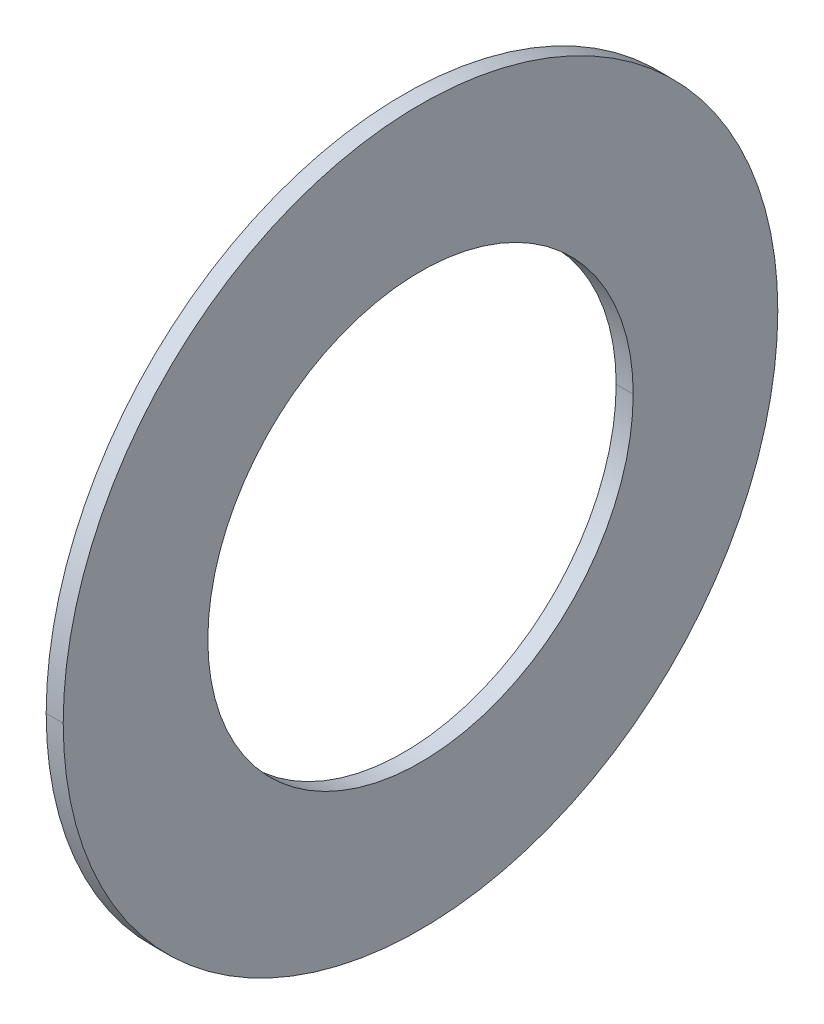
ISO-10303-21;
HEADER;
FILE_DESCRIPTION(('STEP AP214'),'2;1');
FILE_NAME('part.step','',(''),(''),'','','');
FILE_SCHEMA(('AUTOMOTIVE_DESIGN { 1 0 10303 214 1 1 1 1 }'));
ENDSEC;
DATA;
#1=APPLICATION_CONTEXT('core data for automotive mechanical design processes');
#2=APPLICATION_PROTOCOL_DEFINITION('international standard','automotive_design',2000,#1);
#3=PRODUCT_CONTEXT('',#1,'mechanical');
#4=PRODUCT('Part','Part','',(#3));
#5=PRODUCT_RELATED_PRODUCT_CATEGORY('part','',(#4));
#6=PRODUCT_DEFINITION_FORMATION('','',#4);
#7=PRODUCT_DEFINITION_CONTEXT('part definition',#1,'design');
#8=PRODUCT_DEFINITION('design','',#6,#7);
#9=PRODUCT_DEFINITION_SHAPE('','',#8);
#10=(LENGTH_UNIT() NAMED_UNIT(*) SI_UNIT(.MILLI.,.METRE.));
#11=(NAMED_UNIT(*) PLANE_ANGLE_UNIT() SI_UNIT($,.RADIAN.));
#12=(NAMED_UNIT(*) SI_UNIT($,.STERADIAN.) SOLID_ANGLE_UNIT());
#13=UNCERTAINTY_MEASURE_WITH_UNIT(LENGTH_MEASURE(1.E-05),#10,'distance_accuracy_value','');
#14=(GEOMETRIC_REPRESENTATION_CONTEXT(3) GLOBAL_UNCERTAINTY_ASSIGNED_CONTEXT((#13)) GLOBAL_UNIT_ASSIGNED_CONTEXT((#10,
#11,#12)) REPRESENTATION_CONTEXT('',''));
#15=CARTESIAN_POINT('',(0.,0.,0.));
#16=DIRECTION('',(0.,0.,1.));
#17=DIRECTION('',(1.,0.,0.));
#18=AXIS2_PLACEMENT_3D('',#15,#16,#17);
#19=CARTESIAN_POINT('',(1.,21.,0.));
#20=DIRECTION('',(-1.,0.,0.));
#21=DIRECTION('',(0.,0.,1.));
#22=AXIS2_PLACEMENT_3D('',#19,#20,#21);
#23=PLANE('',#22);
#24=CARTESIAN_POINT('',(1.,0.,0.));
#25=DIRECTION('',(1.,0.,0.));
#26=DIRECTION('',(0.,0.,-1.));
#27=AXIS2_PLACEMENT_3D('',#24,#25,#26);
#28=CIRCLE('',#27,12.5);
#29=CARTESIAN_POINT('',(1.,0.,-12.5));
#30=VERTEX_POINT('',#29);
#31=CARTESIAN_POINT('',(1.,0.,12.5));
#32=VERTEX_POINT('',#31);
#33=EDGE_CURVE('E11',#30,#32,#28,.T.);
#34=ORIENTED_EDGE('',*,*,#33,.T.);
#35=CARTESIAN_POINT('',(1.,0.,0.));
#36=DIRECTION('',(1.,0.,0.));
#37=DIRECTION('',(0.,0.,-1.));
#38=AXIS2_PLACEMENT_3D('',#35,#36,#37);
#39=CIRCLE('',#38,12.5);
#40=EDGE_CURVE('E25',#32,#30,#39,.T.);
#41=ORIENTED_EDGE('',*,*,#40,.T.);
#42=EDGE_LOOP('',(#34,#41));
#43=FACE_BOUND('',#42,.T.);
#44=CARTESIAN_POINT('',(1.,0.,0.));
#45=DIRECTION('',(1.,0.,0.));
#46=DIRECTION('',(0.,0.,-1.));
#47=AXIS2_PLACEMENT_3D('',#44,#45,#46);
#48=CIRCLE('',#47,21.);
#49=CARTESIAN_POINT('',(1.,0.,21.));
#50=VERTEX_POINT('',#49);
#51=CARTESIAN_POINT('',(1.,0.,-21.));
#52=VERTEX_POINT('',#51);
#53=EDGE_CURVE('E95',#50,#52,#48,.T.);
#54=ORIENTED_EDGE('',*,*,#53,.F.);
#55=CARTESIAN_POINT('',(1.,0.,0.));
#56=DIRECTION('',(1.,0.,0.));
#57=DIRECTION('',(0.,0.,-1.));
#58=AXIS2_PLACEMENT_3D('',#55,#56,#57);
#59=CIRCLE('',#58,21.);
#60=EDGE_CURVE('E90',#52,#50,#59,.T.);
#61=ORIENTED_EDGE('',*,*,#60,.F.);
#62=EDGE_LOOP('',(#54,#61));
#63=FACE_BOUND('',#62,.T.);
#64=ADVANCED_FACE('F17',(#43,#63),#23,.T.);
#65=CARTESIAN_POINT('',(50.,0.,0.));
#66=DIRECTION('',(1.,0.,0.));
#67=DIRECTION('',(0.,-1.,0.));
#68=AXIS2_PLACEMENT_3D('',#65,#66,#67);
#69=CYLINDRICAL_SURFACE('',#68,21.);
#70=DIRECTION('',(1.,0.,0.));
#71=VECTOR('',#70,1.);
#72=CARTESIAN_POINT('',(1.,0.,21.));
#73=LINE('',#72,#71);
#74=CARTESIAN_POINT('',(2.,0.,21.));
#75=VERTEX_POINT('',#74);
#76=EDGE_CURVE('E86',#50,#75,#73,.T.);
#77=ORIENTED_EDGE('',*,*,#76,.T.);
#78=CARTESIAN_POINT('',(2.,0.,0.));
#79=DIRECTION('',(1.,0.,0.));
#80=DIRECTION('',(0.,0.,-1.));
#81=AXIS2_PLACEMENT_3D('',#78,#79,#80);
#82=CIRCLE('',#81,21.);
#83=CARTESIAN_POINT('',(2.,0.,-21.));
#84=VERTEX_POINT('',#83);
#85=EDGE_CURVE('E81',#84,#75,#82,.T.);
#86=ORIENTED_EDGE('',*,*,#85,.F.);
#87=DIRECTION('',(1.,0.,0.));
#88=VECTOR('',#87,1.);
#89=CARTESIAN_POINT('',(1.,0.,-21.));
#90=LINE('',#89,#88);
#91=EDGE_CURVE('E70',#52,#84,#90,.T.);
#92=ORIENTED_EDGE('',*,*,#91,.F.);
#93=ORIENTED_EDGE('',*,*,#60,.T.);
#94=EDGE_LOOP('',(#77,#86,#92,#93));
#95=FACE_BOUND('',#94,.T.);
#96=ADVANCED_FACE('F111',(#95),#69,.T.);
#97=CARTESIAN_POINT('',(50.,0.,0.));
#98=DIRECTION('',(1.,0.,0.));
#99=DIRECTION('',(0.,1.,0.));
#100=AXIS2_PLACEMENT_3D('',#97,#98,#99);
#101=CYLINDRICAL_SURFACE('',#100,21.);
#102=ORIENTED_EDGE('',*,*,#76,.F.);
#103=ORIENTED_EDGE('',*,*,#53,.T.);
#104=ORIENTED_EDGE('',*,*,#91,.T.);
#105=CARTESIAN_POINT('',(2.,0.,0.));
#106=DIRECTION('',(1.,0.,0.));
#107=DIRECTION('',(0.,0.,-1.));
#108=AXIS2_PLACEMENT_3D('',#105,#106,#107);
#109=CIRCLE('',#108,21.);
#110=EDGE_CURVE('E67',#75,#84,#109,.T.);
#111=ORIENTED_EDGE('',*,*,#110,.F.);
#112=EDGE_LOOP('',(#102,#103,#104,#111));
#113=FACE_BOUND('',#112,.T.);
#114=ADVANCED_FACE('F106',(#113),#101,.T.);
#115=CARTESIAN_POINT('',(2.,12.5,0.));
#116=DIRECTION('',(1.,0.,0.));
#117=DIRECTION('',(0.,0.,-1.));
#118=AXIS2_PLACEMENT_3D('',#115,#116,#117);
#119=PLANE('',#118);
#120=ORIENTED_EDGE('',*,*,#85,.T.);
#121=ORIENTED_EDGE('',*,*,#110,.T.);
#122=EDGE_LOOP('',(#120,#121));
#123=FACE_BOUND('',#122,.T.);
#124=CARTESIAN_POINT('',(2.,0.,0.));
#125=DIRECTION('',(1.,0.,0.));
#126=DIRECTION('',(0.,0.,-1.));
#127=AXIS2_PLACEMENT_3D('',#124,#125,#126);
#128=CIRCLE('',#127,12.5);
#129=CARTESIAN_POINT('',(2.,0.,12.5));
#130=VERTEX_POINT('',#129);
#131=CARTESIAN_POINT('',(2.,0.,-12.5));
#132=VERTEX_POINT('',#131);
#133=EDGE_CURVE('E55',#130,#132,#128,.T.);
#134=ORIENTED_EDGE('',*,*,#133,.F.);
#135=CARTESIAN_POINT('',(2.,0.,0.));
#136=DIRECTION('',(1.,0.,0.));
#137=DIRECTION('',(0.,0.,-1.));
#138=AXIS2_PLACEMENT_3D('',#135,#136,#137);
#139=CIRCLE('',#138,12.5);
#140=EDGE_CURVE('E51',#132,#130,#139,.T.);
#141=ORIENTED_EDGE('',*,*,#140,.F.);
#142=EDGE_LOOP('',(#134,#141));
#143=FACE_BOUND('',#142,.T.);
#144=ADVANCED_FACE('F53',(#123,#143),#119,.T.);
#145=CARTESIAN_POINT('',(50.,0.,0.));
#146=DIRECTION('',(1.,0.,0.));
#147=DIRECTION('',(0.,-1.,0.));
#148=AXIS2_PLACEMENT_3D('',#145,#146,#147);
#149=CYLINDRICAL_SURFACE('',#148,12.5);
#150=DIRECTION('',(1.,0.,0.));
#151=VECTOR('',#150,1.);
#152=CARTESIAN_POINT('',(1.,0.,12.5));
#153=LINE('',#152,#151);
#154=EDGE_CURVE('E59',#32,#130,#153,.T.);
#155=ORIENTED_EDGE('',*,*,#154,.F.);
#156=ORIENTED_EDGE('',*,*,#33,.F.);
#157=DIRECTION('',(1.,0.,0.));
#158=VECTOR('',#157,1.);
#159=CARTESIAN_POINT('',(1.,0.,-12.5));
#160=LINE('',#159,#158);
#161=EDGE_CURVE('E62',#30,#132,#160,.T.);
#162=ORIENTED_EDGE('',*,*,#161,.T.);
#163=ORIENTED_EDGE('',*,*,#140,.T.);
#164=EDGE_LOOP('',(#155,#156,#162,#163));
#165=FACE_BOUND('',#164,.T.);
#166=ADVANCED_FACE('F63',(#165),#149,.F.);
#167=CARTESIAN_POINT('',(50.,0.,0.));
#168=DIRECTION('',(1.,0.,0.));
#169=DIRECTION('',(0.,1.,0.));
#170=AXIS2_PLACEMENT_3D('',#167,#168,#169);
#171=CYLINDRICAL_SURFACE('',#170,12.5);
#172=ORIENTED_EDGE('',*,*,#154,.T.);
#173=ORIENTED_EDGE('',*,*,#133,.T.);
#174=ORIENTED_EDGE('',*,*,#161,.F.);
#175=ORIENTED_EDGE('',*,*,#40,.F.);
#176=EDGE_LOOP('',(#172,#173,#174,#175));
#177=FACE_BOUND('',#176,.T.);
#178=ADVANCED_FACE('F66',(#177),#171,.F.);
#179=CLOSED_SHELL('',(#64,#96,#114,#144,#166,#178));
#180=MANIFOLD_SOLID_BREP('B1',#179);
#181=ADVANCED_BREP_SHAPE_REPRESENTATION('',(#18,#180),#14);
#182=SHAPE_DEFINITION_REPRESENTATION(#9,#181);
ENDSEC;
END-ISO-10303-21;
